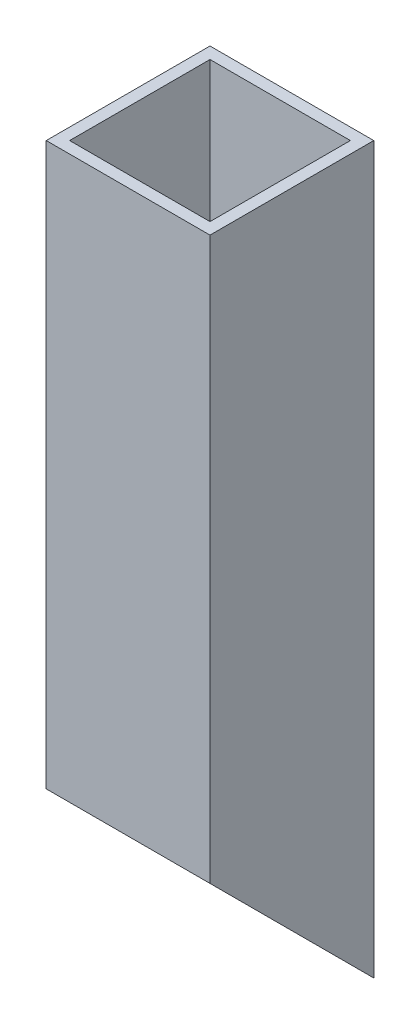
ISO-10303-21;
HEADER;
FILE_DESCRIPTION(('STEP AP214'),'2;1');
FILE_NAME('part.step','',(''),(''),'','','');
FILE_SCHEMA(('AUTOMOTIVE_DESIGN { 1 0 10303 214 1 1 1 1 }'));
ENDSEC;
DATA;
#1=APPLICATION_CONTEXT('core data for automotive mechanical design processes');
#2=APPLICATION_PROTOCOL_DEFINITION('international standard','automotive_design',2000,#1);
#3=PRODUCT_CONTEXT('',#1,'mechanical');
#4=PRODUCT('Part','Part','',(#3));
#5=PRODUCT_RELATED_PRODUCT_CATEGORY('part','',(#4));
#6=PRODUCT_DEFINITION_FORMATION('','',#4);
#7=PRODUCT_DEFINITION_CONTEXT('part definition',#1,'design');
#8=PRODUCT_DEFINITION('design','',#6,#7);
#9=PRODUCT_DEFINITION_SHAPE('','',#8);
#10=(LENGTH_UNIT() NAMED_UNIT(*) SI_UNIT(.MILLI.,.METRE.));
#11=(NAMED_UNIT(*) PLANE_ANGLE_UNIT() SI_UNIT($,.RADIAN.));
#12=(NAMED_UNIT(*) SI_UNIT($,.STERADIAN.) SOLID_ANGLE_UNIT());
#13=UNCERTAINTY_MEASURE_WITH_UNIT(LENGTH_MEASURE(1.E-05),#10,'distance_accuracy_value','');
#14=(GEOMETRIC_REPRESENTATION_CONTEXT(3) GLOBAL_UNCERTAINTY_ASSIGNED_CONTEXT((#13)) GLOBAL_UNIT_ASSIGNED_CONTEXT((#10,
#11,#12)) REPRESENTATION_CONTEXT('',''));
#15=CARTESIAN_POINT('',(0.,0.,0.));
#16=DIRECTION('',(0.,0.,1.));
#17=DIRECTION('',(1.,0.,0.));
#18=AXIS2_PLACEMENT_3D('',#15,#16,#17);
#19=CARTESIAN_POINT('',(3.13984949151802E-13,196.85,0.));
#20=DIRECTION('',(0.,-1.,0.));
#21=DIRECTION('',(0.,0.,-1.));
#22=AXIS2_PLACEMENT_3D('',#19,#20,#21);
#23=PLANE('',#22);
#24=DIRECTION('',(0.,0.,1.));
#25=VECTOR('',#24,1.);
#26=CARTESIAN_POINT('',(3.13984949151802E-13,196.85,0.));
#27=LINE('',#26,#25);
#28=CARTESIAN_POINT('',(3.13984949151802E-13,196.85,-44.45));
#29=VERTEX_POINT('',#28);
#30=CARTESIAN_POINT('',(3.13984949151802E-13,196.85,0.));
#31=VERTEX_POINT('',#30);
#32=EDGE_CURVE('E121',#29,#31,#27,.T.);
#33=ORIENTED_EDGE('',*,*,#32,.T.);
#34=DIRECTION('',(1.,0.,0.));
#35=VECTOR('',#34,1.);
#36=CARTESIAN_POINT('',(3.13984949151802E-13,196.85,0.));
#37=LINE('',#36,#35);
#38=CARTESIAN_POINT('',(44.4500000000003,196.85,0.));
#39=VERTEX_POINT('',#38);
#40=EDGE_CURVE('E127',#31,#39,#37,.T.);
#41=ORIENTED_EDGE('',*,*,#40,.T.);
#42=DIRECTION('',(0.,0.,-1.));
#43=VECTOR('',#42,1.);
#44=CARTESIAN_POINT('',(44.4500000000003,196.85,0.));
#45=LINE('',#44,#43);
#46=CARTESIAN_POINT('',(44.4500000000003,196.85,-44.45));
#47=VERTEX_POINT('',#46);
#48=EDGE_CURVE('E124',#39,#47,#45,.T.);
#49=ORIENTED_EDGE('',*,*,#48,.T.);
#50=DIRECTION('',(-1.,0.,0.));
#51=VECTOR('',#50,1.);
#52=CARTESIAN_POINT('',(3.13984949151802E-13,196.85,-44.45));
#53=LINE('',#52,#51);
#54=EDGE_CURVE('E118',#47,#29,#53,.T.);
#55=ORIENTED_EDGE('',*,*,#54,.T.);
#56=EDGE_LOOP('',(#33,#41,#49,#55));
#57=FACE_BOUND('',#56,.T.);
#58=DIRECTION('',(1.,0.,0.));
#59=VECTOR('',#58,1.);
#60=CARTESIAN_POINT('',(3.17500000000032,196.85,-3.175));
#61=LINE('',#60,#59);
#62=CARTESIAN_POINT('',(3.17500000000032,196.85,-3.175));
#63=VERTEX_POINT('',#62);
#64=CARTESIAN_POINT('',(41.2750000000003,196.85,-3.1749999999998));
#65=VERTEX_POINT('',#64);
#66=EDGE_CURVE('E89',#63,#65,#61,.T.);
#67=ORIENTED_EDGE('',*,*,#66,.F.);
#68=DIRECTION('',(0.,0.,1.));
#69=VECTOR('',#68,1.);
#70=CARTESIAN_POINT('',(3.17500000000032,196.85,-3.175));
#71=LINE('',#70,#69);
#72=CARTESIAN_POINT('',(3.17500000000031,196.85,-41.275));
#73=VERTEX_POINT('',#72);
#74=EDGE_CURVE('E137',#73,#63,#71,.T.);
#75=ORIENTED_EDGE('',*,*,#74,.F.);
#76=DIRECTION('',(-1.,0.,0.));
#77=VECTOR('',#76,1.);
#78=CARTESIAN_POINT('',(3.17500000000031,196.85,-41.275));
#79=LINE('',#78,#77);
#80=CARTESIAN_POINT('',(41.2750000000002,196.85,-41.275));
#81=VERTEX_POINT('',#80);
#82=EDGE_CURVE('E140',#81,#73,#79,.T.);
#83=ORIENTED_EDGE('',*,*,#82,.F.);
#84=DIRECTION('',(0.,0.,-1.));
#85=VECTOR('',#84,1.);
#86=CARTESIAN_POINT('',(41.2750000000003,196.85,-3.1749999999998));
#87=LINE('',#86,#85);
#88=EDGE_CURVE('E99',#65,#81,#87,.T.);
#89=ORIENTED_EDGE('',*,*,#88,.F.);
#90=EDGE_LOOP('',(#67,#75,#83,#89));
#91=FACE_BOUND('',#90,.T.);
#92=ADVANCED_FACE('F34',(#57,#91),#23,.F.);
#93=CARTESIAN_POINT('',(3.13984949151802E-13,196.85,0.));
#94=DIRECTION('',(1.,0.,0.));
#95=DIRECTION('',(0.,0.,-1.));
#96=AXIS2_PLACEMENT_3D('',#93,#94,#95);
#97=PLANE('',#96);
#98=DIRECTION('',(0.,-1.,0.));
#99=VECTOR('',#98,1.);
#100=CARTESIAN_POINT('',(3.13984949151802E-13,196.85,-44.45));
#101=LINE('',#100,#99);
#102=CARTESIAN_POINT('',(0.,0.,-44.45));
#103=VERTEX_POINT('',#102);
#104=EDGE_CURVE('E116',#29,#103,#101,.T.);
#105=ORIENTED_EDGE('',*,*,#104,.T.);
#106=DIRECTION('',(0.,0.707106781186546,0.707106781186549));
#107=VECTOR('',#106,1.);
#108=CARTESIAN_POINT('',(1.02348685082632E-13,44.45,0.));
#109=LINE('',#108,#107);
#110=CARTESIAN_POINT('',(1.02348685082632E-13,44.45,0.));
#111=VERTEX_POINT('',#110);
#112=EDGE_CURVE('E11',#103,#111,#109,.T.);
#113=ORIENTED_EDGE('',*,*,#112,.T.);
#114=DIRECTION('',(0.,-1.,0.));
#115=VECTOR('',#114,1.);
#116=CARTESIAN_POINT('',(3.13984949151802E-13,196.85,0.));
#117=LINE('',#116,#115);
#118=EDGE_CURVE('E108',#31,#111,#117,.T.);
#119=ORIENTED_EDGE('',*,*,#118,.F.);
#120=ORIENTED_EDGE('',*,*,#32,.F.);
#121=EDGE_LOOP('',(#105,#113,#119,#120));
#122=FACE_BOUND('',#121,.T.);
#123=ADVANCED_FACE('F174',(#122),#97,.F.);
#124=CARTESIAN_POINT('',(3.13984949151802E-13,196.85,0.));
#125=DIRECTION('',(0.,0.,-1.));
#126=DIRECTION('',(-1.,0.,0.));
#127=AXIS2_PLACEMENT_3D('',#124,#125,#126);
#128=PLANE('',#127);
#129=ORIENTED_EDGE('',*,*,#118,.T.);
#130=DIRECTION('',(1.,0.,0.));
#131=VECTOR('',#130,1.);
#132=CARTESIAN_POINT('',(44.4500000000001,44.4500000000001,0.));
#133=LINE('',#132,#131);
#134=CARTESIAN_POINT('',(44.4500000000001,44.4500000000001,0.));
#135=VERTEX_POINT('',#134);
#136=EDGE_CURVE('E105',#111,#135,#133,.T.);
#137=ORIENTED_EDGE('',*,*,#136,.T.);
#138=DIRECTION('',(0.,-1.,0.));
#139=VECTOR('',#138,1.);
#140=CARTESIAN_POINT('',(44.4500000000003,196.85,0.));
#141=LINE('',#140,#139);
#142=EDGE_CURVE('E110',#39,#135,#141,.T.);
#143=ORIENTED_EDGE('',*,*,#142,.F.);
#144=ORIENTED_EDGE('',*,*,#40,.F.);
#145=EDGE_LOOP('',(#129,#137,#143,#144));
#146=FACE_BOUND('',#145,.T.);
#147=ADVANCED_FACE('F178',(#146),#128,.F.);
#148=CARTESIAN_POINT('',(44.4500000000003,196.85,0.));
#149=DIRECTION('',(-1.,0.,0.));
#150=DIRECTION('',(0.,0.,1.));
#151=AXIS2_PLACEMENT_3D('',#148,#149,#150);
#152=PLANE('',#151);
#153=ORIENTED_EDGE('',*,*,#142,.T.);
#154=DIRECTION('',(0.,-0.707106781186546,-0.707106781186549));
#155=VECTOR('',#154,1.);
#156=CARTESIAN_POINT('',(44.4500000000001,44.4500000000001,0.));
#157=LINE('',#156,#155);
#158=CARTESIAN_POINT('',(44.45,2.08166817117217E-13,-44.45));
#159=VERTEX_POINT('',#158);
#160=EDGE_CURVE('E44',#135,#159,#157,.T.);
#161=ORIENTED_EDGE('',*,*,#160,.T.);
#162=DIRECTION('',(0.,-1.,0.));
#163=VECTOR('',#162,1.);
#164=CARTESIAN_POINT('',(44.4500000000003,196.85,-44.45));
#165=LINE('',#164,#163);
#166=EDGE_CURVE('E113',#47,#159,#165,.T.);
#167=ORIENTED_EDGE('',*,*,#166,.F.);
#168=ORIENTED_EDGE('',*,*,#48,.F.);
#169=EDGE_LOOP('',(#153,#161,#167,#168));
#170=FACE_BOUND('',#169,.T.);
#171=ADVANCED_FACE('F181',(#170),#152,.F.);
#172=CARTESIAN_POINT('',(3.13984949151802E-13,196.85,-44.45));
#173=DIRECTION('',(0.,0.,1.));
#174=DIRECTION('',(1.,0.,0.));
#175=AXIS2_PLACEMENT_3D('',#172,#173,#174);
#176=PLANE('',#175);
#177=DIRECTION('',(-1.,0.,0.));
#178=VECTOR('',#177,1.);
#179=CARTESIAN_POINT('',(0.,0.,-44.45));
#180=LINE('',#179,#178);
#181=EDGE_CURVE('E90',#159,#103,#180,.T.);
#182=ORIENTED_EDGE('',*,*,#181,.T.);
#183=ORIENTED_EDGE('',*,*,#104,.F.);
#184=ORIENTED_EDGE('',*,*,#54,.F.);
#185=ORIENTED_EDGE('',*,*,#166,.T.);
#186=EDGE_LOOP('',(#182,#183,#184,#185));
#187=FACE_BOUND('',#186,.T.);
#188=ADVANCED_FACE('F169',(#187),#176,.F.);
#189=CARTESIAN_POINT('',(3.17500000000032,196.85,-3.175));
#190=DIRECTION('',(0.,0.,-1.));
#191=DIRECTION('',(-1.,0.,0.));
#192=AXIS2_PLACEMENT_3D('',#189,#190,#191);
#193=PLANE('',#192);
#194=DIRECTION('',(1.,0.,0.));
#195=VECTOR('',#194,1.);
#196=CARTESIAN_POINT('',(1.02348685082632E-13,41.275,-3.175));
#197=LINE('',#196,#195);
#198=CARTESIAN_POINT('',(3.1750000000001,41.275,-3.175));
#199=VERTEX_POINT('',#198);
#200=CARTESIAN_POINT('',(41.2750000000001,41.2750000000001,-3.1749999999998));
#201=VERTEX_POINT('',#200);
#202=EDGE_CURVE('E38',#199,#201,#197,.T.);
#203=ORIENTED_EDGE('',*,*,#202,.F.);
#204=DIRECTION('',(0.,-1.,0.));
#205=VECTOR('',#204,1.);
#206=CARTESIAN_POINT('',(3.17500000000032,196.85,-3.175));
#207=LINE('',#206,#205);
#208=EDGE_CURVE('E135',#63,#199,#207,.T.);
#209=ORIENTED_EDGE('',*,*,#208,.F.);
#210=ORIENTED_EDGE('',*,*,#66,.T.);
#211=DIRECTION('',(0.,-1.,0.));
#212=VECTOR('',#211,1.);
#213=CARTESIAN_POINT('',(41.2750000000003,196.85,-3.1749999999998));
#214=LINE('',#213,#212);
#215=EDGE_CURVE('E73',#65,#201,#214,.T.);
#216=ORIENTED_EDGE('',*,*,#215,.T.);
#217=EDGE_LOOP('',(#203,#209,#210,#216));
#218=FACE_BOUND('',#217,.T.);
#219=ADVANCED_FACE('F85',(#218),#193,.T.);
#220=CARTESIAN_POINT('',(41.2750000000003,196.85,-3.1749999999998));
#221=DIRECTION('',(-1.,0.,0.));
#222=DIRECTION('',(0.,0.,1.));
#223=AXIS2_PLACEMENT_3D('',#220,#221,#222);
#224=PLANE('',#223);
#225=DIRECTION('',(0.,-0.707106781186546,-0.707106781186549));
#226=VECTOR('',#225,1.);
#227=CARTESIAN_POINT('',(41.2750000000001,44.4500000000001,1.94289029309402E-13));
#228=LINE('',#227,#226);
#229=CARTESIAN_POINT('',(41.2749999999999,3.17500000000018,-41.275));
#230=VERTEX_POINT('',#229);
#231=EDGE_CURVE('E69',#201,#230,#228,.T.);
#232=ORIENTED_EDGE('',*,*,#231,.F.);
#233=ORIENTED_EDGE('',*,*,#215,.F.);
#234=ORIENTED_EDGE('',*,*,#88,.T.);
#235=DIRECTION('',(0.,-1.,0.));
#236=VECTOR('',#235,1.);
#237=CARTESIAN_POINT('',(41.2750000000002,196.85,-41.275));
#238=LINE('',#237,#236);
#239=EDGE_CURVE('E76',#81,#230,#238,.T.);
#240=ORIENTED_EDGE('',*,*,#239,.T.);
#241=EDGE_LOOP('',(#232,#233,#234,#240));
#242=FACE_BOUND('',#241,.T.);
#243=ADVANCED_FACE('F71',(#242),#224,.T.);
#244=CARTESIAN_POINT('',(3.17500000000031,196.85,-41.275));
#245=DIRECTION('',(0.,0.,1.));
#246=DIRECTION('',(1.,0.,0.));
#247=AXIS2_PLACEMENT_3D('',#244,#245,#246);
#248=PLANE('',#247);
#249=DIRECTION('',(-1.,0.,0.));
#250=VECTOR('',#249,1.);
#251=CARTESIAN_POINT('',(0.,3.17500000000015,-41.275));
#252=LINE('',#251,#250);
#253=CARTESIAN_POINT('',(3.175,3.17500000000018,-41.275));
#254=VERTEX_POINT('',#253);
#255=EDGE_CURVE('E81',#230,#254,#252,.T.);
#256=ORIENTED_EDGE('',*,*,#255,.F.);
#257=ORIENTED_EDGE('',*,*,#239,.F.);
#258=ORIENTED_EDGE('',*,*,#82,.T.);
#259=DIRECTION('',(0.,-1.,0.));
#260=VECTOR('',#259,1.);
#261=CARTESIAN_POINT('',(3.17500000000031,196.85,-41.275));
#262=LINE('',#261,#260);
#263=EDGE_CURVE('E133',#73,#254,#262,.T.);
#264=ORIENTED_EDGE('',*,*,#263,.T.);
#265=EDGE_LOOP('',(#256,#257,#258,#264));
#266=FACE_BOUND('',#265,.T.);
#267=ADVANCED_FACE('F149',(#266),#248,.T.);
#268=CARTESIAN_POINT('',(3.17500000000032,196.85,-3.175));
#269=DIRECTION('',(1.,0.,0.));
#270=DIRECTION('',(0.,0.,-1.));
#271=AXIS2_PLACEMENT_3D('',#268,#269,#270);
#272=PLANE('',#271);
#273=DIRECTION('',(0.,0.707106781186546,0.707106781186549));
#274=VECTOR('',#273,1.);
#275=CARTESIAN_POINT('',(3.17500000000009,44.45,0.));
#276=LINE('',#275,#274);
#277=EDGE_CURVE('E94',#254,#199,#276,.T.);
#278=ORIENTED_EDGE('',*,*,#277,.F.);
#279=ORIENTED_EDGE('',*,*,#263,.F.);
#280=ORIENTED_EDGE('',*,*,#74,.T.);
#281=ORIENTED_EDGE('',*,*,#208,.T.);
#282=EDGE_LOOP('',(#278,#279,#280,#281));
#283=FACE_BOUND('',#282,.T.);
#284=ADVANCED_FACE('F151',(#283),#272,.T.);
#285=CARTESIAN_POINT('',(1.02348685082632E-13,44.45,0.));
#286=DIRECTION('',(0.,-0.707106781186549,0.707106781186546));
#287=DIRECTION('',(-1.,0.,0.));
#288=AXIS2_PLACEMENT_3D('',#285,#286,#287);
#289=PLANE('',#288);
#290=ORIENTED_EDGE('',*,*,#112,.F.);
#291=ORIENTED_EDGE('',*,*,#181,.F.);
#292=ORIENTED_EDGE('',*,*,#160,.F.);
#293=ORIENTED_EDGE('',*,*,#136,.F.);
#294=EDGE_LOOP('',(#290,#291,#292,#293));
#295=FACE_BOUND('',#294,.T.);
#296=ORIENTED_EDGE('',*,*,#277,.T.);
#297=ORIENTED_EDGE('',*,*,#202,.T.);
#298=ORIENTED_EDGE('',*,*,#231,.T.);
#299=ORIENTED_EDGE('',*,*,#255,.T.);
#300=EDGE_LOOP('',(#296,#297,#298,#299));
#301=FACE_BOUND('',#300,.T.);
#302=ADVANCED_FACE('F36',(#295,#301),#289,.T.);
#303=CLOSED_SHELL('',(#92,#123,#147,#171,#188,#219,#243,#267,#284,#302));
#304=MANIFOLD_SOLID_BREP('B2',#303);
#305=ADVANCED_BREP_SHAPE_REPRESENTATION('',(#18,#304),#14);
#306=SHAPE_DEFINITION_REPRESENTATION(#9,#305);
ENDSEC;
END-ISO-10303-21;
